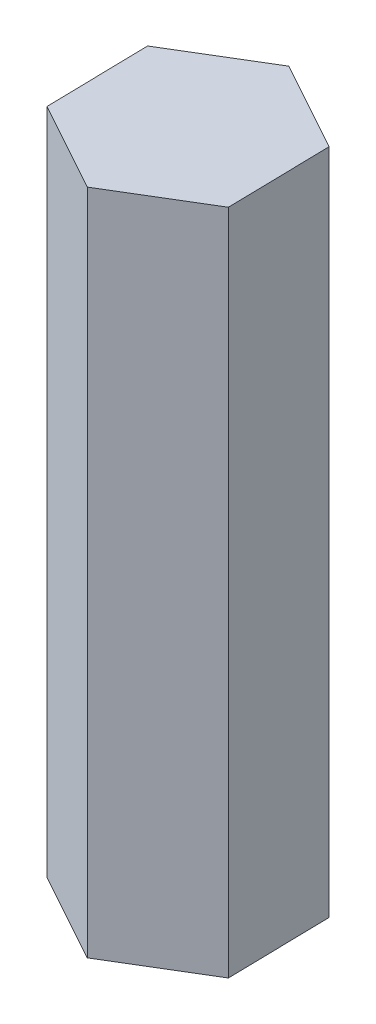
ISO-10303-21;
HEADER;
FILE_DESCRIPTION(('STEP AP214'),'2;1');
FILE_NAME('part.step','',(''),(''),'','','');
FILE_SCHEMA(('AUTOMOTIVE_DESIGN { 1 0 10303 214 1 1 1 1 }'));
ENDSEC;
DATA;
#1=APPLICATION_CONTEXT('core data for automotive mechanical design processes');
#2=APPLICATION_PROTOCOL_DEFINITION('international standard','automotive_design',2000,#1);
#3=PRODUCT_CONTEXT('',#1,'mechanical');
#4=PRODUCT('Part','Part','',(#3));
#5=PRODUCT_RELATED_PRODUCT_CATEGORY('part','',(#4));
#6=PRODUCT_DEFINITION_FORMATION('','',#4);
#7=PRODUCT_DEFINITION_CONTEXT('part definition',#1,'design');
#8=PRODUCT_DEFINITION('design','',#6,#7);
#9=PRODUCT_DEFINITION_SHAPE('','',#8);
#10=(LENGTH_UNIT() NAMED_UNIT(*) SI_UNIT(.MILLI.,.METRE.));
#11=(NAMED_UNIT(*) PLANE_ANGLE_UNIT() SI_UNIT($,.RADIAN.));
#12=(NAMED_UNIT(*) SI_UNIT($,.STERADIAN.) SOLID_ANGLE_UNIT());
#13=UNCERTAINTY_MEASURE_WITH_UNIT(LENGTH_MEASURE(1.E-05),#10,'distance_accuracy_value','');
#14=(GEOMETRIC_REPRESENTATION_CONTEXT(3) GLOBAL_UNCERTAINTY_ASSIGNED_CONTEXT((#13)) GLOBAL_UNIT_ASSIGNED_CONTEXT((#10,
#11,#12)) REPRESENTATION_CONTEXT('',''));
#15=CARTESIAN_POINT('',(0.,0.,0.));
#16=DIRECTION('',(0.,0.,1.));
#17=DIRECTION('',(1.,0.,0.));
#18=AXIS2_PLACEMENT_3D('',#15,#16,#17);
#19=CARTESIAN_POINT('',(0.0918320640744872,30.,4.61788915039557));
#20=DIRECTION('',(-0.517119676526855,0.,-0.855913103152862));
#21=DIRECTION('',(-0.855913103152862,0.,0.517119676526855));
#22=AXIS2_PLACEMENT_3D('',#19,#20,#21);
#23=PLANE('',#22);
#24=DIRECTION('',(0.855913103152862,0.,-0.517119676526855));
#25=VECTOR('',#24,1.);
#26=CARTESIAN_POINT('',(0.0918320640744872,0.,4.61788915039557));
#27=LINE('',#26,#25);
#28=CARTESIAN_POINT('',(0.0918320640744872,0.,4.61788915039557));
#29=VERTEX_POINT('',#28);
#30=CARTESIAN_POINT('',(4.04512534814035,0.,2.22941567482732));
#31=VERTEX_POINT('',#30);
#32=EDGE_CURVE('E119',#29,#31,#27,.T.);
#33=ORIENTED_EDGE('',*,*,#32,.T.);
#34=DIRECTION('',(0.,-1.,0.));
#35=VECTOR('',#34,1.);
#36=CARTESIAN_POINT('',(4.04512534814035,30.,2.22941567482732));
#37=LINE('',#36,#35);
#38=CARTESIAN_POINT('',(4.04512534814035,30.,2.22941567482732));
#39=VERTEX_POINT('',#38);
#40=EDGE_CURVE('E11',#39,#31,#37,.T.);
#41=ORIENTED_EDGE('',*,*,#40,.F.);
#42=DIRECTION('',(0.855913103152862,0.,-0.517119676526855));
#43=VECTOR('',#42,1.);
#44=CARTESIAN_POINT('',(0.0918320640744872,30.,4.61788915039557));
#45=LINE('',#44,#43);
#46=CARTESIAN_POINT('',(0.0918320640744872,30.,4.61788915039557));
#47=VERTEX_POINT('',#46);
#48=EDGE_CURVE('E129',#47,#39,#45,.T.);
#49=ORIENTED_EDGE('',*,*,#48,.F.);
#50=DIRECTION('',(0.,-1.,0.));
#51=VECTOR('',#50,1.);
#52=CARTESIAN_POINT('',(0.0918320640744872,30.,4.61788915039557));
#53=LINE('',#52,#51);
#54=EDGE_CURVE('E115',#47,#29,#53,.T.);
#55=ORIENTED_EDGE('',*,*,#54,.T.);
#56=EDGE_LOOP('',(#33,#41,#49,#55));
#57=FACE_BOUND('',#56,.T.);
#58=ADVANCED_FACE('F35',(#57),#23,.F.);
#59=CARTESIAN_POINT('',(4.04512534814035,30.,2.22941567482732));
#60=DIRECTION('',(-0.999802329025776,0.,0.0198822250926169));
#61=DIRECTION('',(0.0198822250926169,0.,0.999802329025776));
#62=AXIS2_PLACEMENT_3D('',#59,#60,#61);
#63=PLANE('',#62);
#64=DIRECTION('',(-0.0198822250926169,0.,-0.999802329025776));
#65=VECTOR('',#64,1.);
#66=CARTESIAN_POINT('',(4.04512534814035,0.,2.22941567482732));
#67=LINE('',#66,#65);
#68=CARTESIAN_POINT('',(3.95329328406586,0.,-2.38847347556826));
#69=VERTEX_POINT('',#68);
#70=EDGE_CURVE('E122',#31,#69,#67,.T.);
#71=ORIENTED_EDGE('',*,*,#70,.T.);
#72=DIRECTION('',(0.,-1.,0.));
#73=VECTOR('',#72,1.);
#74=CARTESIAN_POINT('',(3.95329328406586,30.,-2.38847347556826));
#75=LINE('',#74,#73);
#76=CARTESIAN_POINT('',(3.95329328406586,30.,-2.38847347556826));
#77=VERTEX_POINT('',#76);
#78=EDGE_CURVE('E43',#77,#69,#75,.T.);
#79=ORIENTED_EDGE('',*,*,#78,.F.);
#80=DIRECTION('',(-0.0198822250926169,0.,-0.999802329025776));
#81=VECTOR('',#80,1.);
#82=CARTESIAN_POINT('',(4.04512534814035,30.,2.22941567482732));
#83=LINE('',#82,#81);
#84=EDGE_CURVE('E88',#39,#77,#83,.T.);
#85=ORIENTED_EDGE('',*,*,#84,.F.);
#86=ORIENTED_EDGE('',*,*,#40,.T.);
#87=EDGE_LOOP('',(#71,#79,#85,#86));
#88=FACE_BOUND('',#87,.T.);
#89=ADVANCED_FACE('F153',(#88),#63,.F.);
#90=CARTESIAN_POINT('',(3.95329328406586,30.,-2.38847347556826));
#91=DIRECTION('',(-0.482682652498922,0.,0.875795328245478));
#92=DIRECTION('',(0.875795328245478,0.,0.482682652498922));
#93=AXIS2_PLACEMENT_3D('',#90,#91,#92);
#94=PLANE('',#93);
#95=DIRECTION('',(-0.875795328245478,0.,-0.482682652498922));
#96=VECTOR('',#95,1.);
#97=CARTESIAN_POINT('',(3.95329328406586,0.,-2.38847347556826));
#98=LINE('',#97,#96);
#99=CARTESIAN_POINT('',(-0.0918320640744872,0.,-4.61788915039558));
#100=VERTEX_POINT('',#99);
#101=EDGE_CURVE('E124',#69,#100,#98,.T.);
#102=ORIENTED_EDGE('',*,*,#101,.T.);
#103=DIRECTION('',(0.,-1.,0.));
#104=VECTOR('',#103,1.);
#105=CARTESIAN_POINT('',(-0.0918320640744872,30.,-4.61788915039558));
#106=LINE('',#105,#104);
#107=CARTESIAN_POINT('',(-0.0918320640744872,30.,-4.61788915039558));
#108=VERTEX_POINT('',#107);
#109=EDGE_CURVE('E110',#108,#100,#106,.T.);
#110=ORIENTED_EDGE('',*,*,#109,.F.);
#111=DIRECTION('',(-0.875795328245478,0.,-0.482682652498922));
#112=VECTOR('',#111,1.);
#113=CARTESIAN_POINT('',(3.95329328406586,30.,-2.38847347556826));
#114=LINE('',#113,#112);
#115=EDGE_CURVE('E101',#77,#108,#114,.T.);
#116=ORIENTED_EDGE('',*,*,#115,.F.);
#117=ORIENTED_EDGE('',*,*,#78,.T.);
#118=EDGE_LOOP('',(#102,#110,#116,#117));
#119=FACE_BOUND('',#118,.T.);
#120=ADVANCED_FACE('F135',(#119),#94,.F.);
#121=CARTESIAN_POINT('',(-0.0918320640744872,30.,-4.61788915039558));
#122=DIRECTION('',(0.517119676526855,0.,0.855913103152862));
#123=DIRECTION('',(0.855913103152862,0.,-0.517119676526855));
#124=AXIS2_PLACEMENT_3D('',#121,#122,#123);
#125=PLANE('',#124);
#126=DIRECTION('',(-0.855913103152862,0.,0.517119676526855));
#127=VECTOR('',#126,1.);
#128=CARTESIAN_POINT('',(-0.0918320640744872,0.,-4.61788915039558));
#129=LINE('',#128,#127);
#130=CARTESIAN_POINT('',(-4.04512534814035,0.,-2.22941567482732));
#131=VERTEX_POINT('',#130);
#132=EDGE_CURVE('E109',#100,#131,#129,.T.);
#133=ORIENTED_EDGE('',*,*,#132,.T.);
#134=DIRECTION('',(0.,-1.,0.));
#135=VECTOR('',#134,1.);
#136=CARTESIAN_POINT('',(-4.04512534814035,30.,-2.22941567482732));
#137=LINE('',#136,#135);
#138=CARTESIAN_POINT('',(-4.04512534814035,30.,-2.22941567482732));
#139=VERTEX_POINT('',#138);
#140=EDGE_CURVE('E106',#139,#131,#137,.T.);
#141=ORIENTED_EDGE('',*,*,#140,.F.);
#142=DIRECTION('',(-0.855913103152862,0.,0.517119676526855));
#143=VECTOR('',#142,1.);
#144=CARTESIAN_POINT('',(-0.0918320640744872,30.,-4.61788915039558));
#145=LINE('',#144,#143);
#146=EDGE_CURVE('E95',#108,#139,#145,.T.);
#147=ORIENTED_EDGE('',*,*,#146,.F.);
#148=ORIENTED_EDGE('',*,*,#109,.T.);
#149=EDGE_LOOP('',(#133,#141,#147,#148));
#150=FACE_BOUND('',#149,.T.);
#151=ADVANCED_FACE('F107',(#150),#125,.F.);
#152=CARTESIAN_POINT('',(-4.04512534814035,30.,-2.22941567482732));
#153=DIRECTION('',(0.999802329025776,0.,-0.0198822250926165));
#154=DIRECTION('',(-0.0198822250926165,0.,-0.999802329025776));
#155=AXIS2_PLACEMENT_3D('',#152,#153,#154);
#156=PLANE('',#155);
#157=DIRECTION('',(0.0198822250926165,0.,0.999802329025776));
#158=VECTOR('',#157,1.);
#159=CARTESIAN_POINT('',(-4.04512534814035,0.,-2.22941567482732));
#160=LINE('',#159,#158);
#161=CARTESIAN_POINT('',(-3.95329328406586,0.,2.38847347556825));
#162=VERTEX_POINT('',#161);
#163=EDGE_CURVE('E74',#131,#162,#160,.T.);
#164=ORIENTED_EDGE('',*,*,#163,.T.);
#165=DIRECTION('',(0.,-1.,0.));
#166=VECTOR('',#165,1.);
#167=CARTESIAN_POINT('',(-3.95329328406586,30.,2.38847347556825));
#168=LINE('',#167,#166);
#169=CARTESIAN_POINT('',(-3.95329328406586,30.,2.38847347556825));
#170=VERTEX_POINT('',#169);
#171=EDGE_CURVE('E111',#170,#162,#168,.T.);
#172=ORIENTED_EDGE('',*,*,#171,.F.);
#173=DIRECTION('',(0.0198822250926165,0.,0.999802329025776));
#174=VECTOR('',#173,1.);
#175=CARTESIAN_POINT('',(-4.04512534814035,30.,-2.22941567482732));
#176=LINE('',#175,#174);
#177=EDGE_CURVE('E99',#139,#170,#176,.T.);
#178=ORIENTED_EDGE('',*,*,#177,.F.);
#179=ORIENTED_EDGE('',*,*,#140,.T.);
#180=EDGE_LOOP('',(#164,#172,#178,#179));
#181=FACE_BOUND('',#180,.T.);
#182=ADVANCED_FACE('F113',(#181),#156,.F.);
#183=CARTESIAN_POINT('',(-3.95329328406586,30.,2.38847347556825));
#184=DIRECTION('',(0.482682652498922,0.,-0.875795328245478));
#185=DIRECTION('',(-0.875795328245478,0.,-0.482682652498922));
#186=AXIS2_PLACEMENT_3D('',#183,#184,#185);
#187=PLANE('',#186);
#188=DIRECTION('',(0.875795328245478,0.,0.482682652498922));
#189=VECTOR('',#188,1.);
#190=CARTESIAN_POINT('',(-3.95329328406586,0.,2.38847347556825));
#191=LINE('',#190,#189);
#192=EDGE_CURVE('E80',#162,#29,#191,.T.);
#193=ORIENTED_EDGE('',*,*,#192,.T.);
#194=ORIENTED_EDGE('',*,*,#54,.F.);
#195=DIRECTION('',(0.875795328245478,0.,0.482682652498922));
#196=VECTOR('',#195,1.);
#197=CARTESIAN_POINT('',(-3.95329328406586,30.,2.38847347556825));
#198=LINE('',#197,#196);
#199=EDGE_CURVE('E51',#170,#47,#198,.T.);
#200=ORIENTED_EDGE('',*,*,#199,.F.);
#201=ORIENTED_EDGE('',*,*,#171,.T.);
#202=EDGE_LOOP('',(#193,#194,#200,#201));
#203=FACE_BOUND('',#202,.T.);
#204=ADVANCED_FACE('F142',(#203),#187,.F.);
#205=CARTESIAN_POINT('',(0.,30.,0.));
#206=DIRECTION('',(0.,1.,0.));
#207=DIRECTION('',(0.,0.,1.));
#208=AXIS2_PLACEMENT_3D('',#205,#206,#207);
#209=PLANE('',#208);
#210=ORIENTED_EDGE('',*,*,#48,.T.);
#211=ORIENTED_EDGE('',*,*,#84,.T.);
#212=ORIENTED_EDGE('',*,*,#115,.T.);
#213=ORIENTED_EDGE('',*,*,#146,.T.);
#214=ORIENTED_EDGE('',*,*,#177,.T.);
#215=ORIENTED_EDGE('',*,*,#199,.T.);
#216=EDGE_LOOP('',(#210,#211,#212,#213,#214,#215));
#217=FACE_BOUND('',#216,.T.);
#218=ADVANCED_FACE('F97',(#217),#209,.T.);
#219=CARTESIAN_POINT('',(0.,0.,0.));
#220=DIRECTION('',(0.,1.,0.));
#221=DIRECTION('',(0.,0.,1.));
#222=AXIS2_PLACEMENT_3D('',#219,#220,#221);
#223=PLANE('',#222);
#224=ORIENTED_EDGE('',*,*,#32,.F.);
#225=ORIENTED_EDGE('',*,*,#192,.F.);
#226=ORIENTED_EDGE('',*,*,#163,.F.);
#227=ORIENTED_EDGE('',*,*,#132,.F.);
#228=ORIENTED_EDGE('',*,*,#101,.F.);
#229=ORIENTED_EDGE('',*,*,#70,.F.);
#230=EDGE_LOOP('',(#224,#225,#226,#227,#228,#229));
#231=FACE_BOUND('',#230,.T.);
#232=ADVANCED_FACE('F138',(#231),#223,.F.);
#233=CLOSED_SHELL('',(#58,#89,#120,#151,#182,#204,#218,#232));
#234=MANIFOLD_SOLID_BREP('B2',#233);
#235=ADVANCED_BREP_SHAPE_REPRESENTATION('',(#18,#234),#14);
#236=SHAPE_DEFINITION_REPRESENTATION(#9,#235);
ENDSEC;
END-ISO-10303-21;
